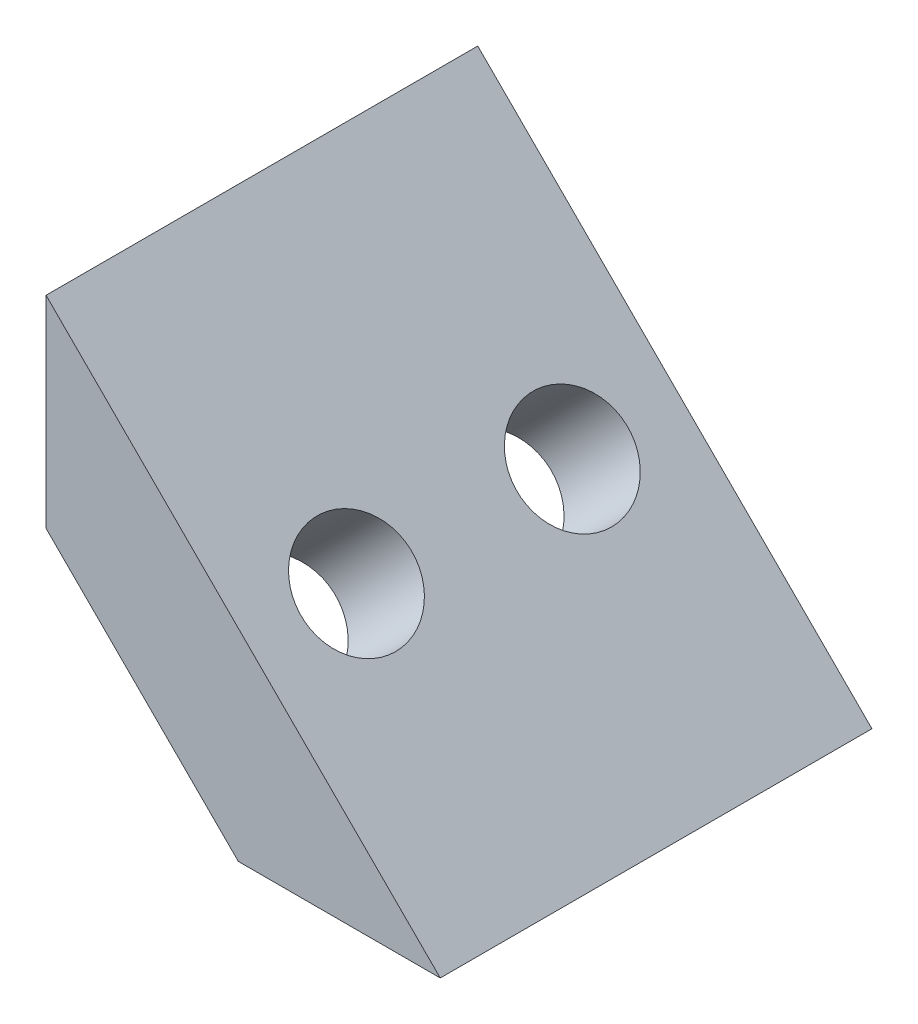
ISO-10303-21;
HEADER;
FILE_DESCRIPTION(('STEP AP214'),'2;1');
FILE_NAME('part.step','',(''),(''),'','','');
FILE_SCHEMA(('AUTOMOTIVE_DESIGN { 1 0 10303 214 1 1 1 1 }'));
ENDSEC;
DATA;
#1=APPLICATION_CONTEXT('core data for automotive mechanical design processes');
#2=APPLICATION_PROTOCOL_DEFINITION('international standard','automotive_design',2000,#1);
#3=PRODUCT_CONTEXT('',#1,'mechanical');
#4=PRODUCT('Part','Part','',(#3));
#5=PRODUCT_RELATED_PRODUCT_CATEGORY('part','',(#4));
#6=PRODUCT_DEFINITION_FORMATION('','',#4);
#7=PRODUCT_DEFINITION_CONTEXT('part definition',#1,'design');
#8=PRODUCT_DEFINITION('design','',#6,#7);
#9=PRODUCT_DEFINITION_SHAPE('','',#8);
#10=(LENGTH_UNIT() NAMED_UNIT(*) SI_UNIT(.MILLI.,.METRE.));
#11=(NAMED_UNIT(*) PLANE_ANGLE_UNIT() SI_UNIT($,.RADIAN.));
#12=(NAMED_UNIT(*) SI_UNIT($,.STERADIAN.) SOLID_ANGLE_UNIT());
#13=UNCERTAINTY_MEASURE_WITH_UNIT(LENGTH_MEASURE(1.E-05),#10,'distance_accuracy_value','');
#14=(GEOMETRIC_REPRESENTATION_CONTEXT(3) GLOBAL_UNCERTAINTY_ASSIGNED_CONTEXT((#13)) GLOBAL_UNIT_ASSIGNED_CONTEXT((#10,
#11,#12)) REPRESENTATION_CONTEXT('',''));
#15=CARTESIAN_POINT('',(0.,0.,0.));
#16=DIRECTION('',(0.,0.,1.));
#17=DIRECTION('',(1.,0.,0.));
#18=AXIS2_PLACEMENT_3D('',#15,#16,#17);
#19=CARTESIAN_POINT('',(0.,5.65685424949239,6.35));
#20=DIRECTION('',(1.,0.,0.));
#21=DIRECTION('',(0.,0.,-1.));
#22=AXIS2_PLACEMENT_3D('',#19,#20,#21);
#23=PLANE('',#22);
#24=DIRECTION('',(0.,-1.,0.));
#25=VECTOR('',#24,1.);
#26=CARTESIAN_POINT('',(0.,5.65685424949239,-6.35));
#27=LINE('',#26,#25);
#28=CARTESIAN_POINT('',(0.,11.5965512114594,-6.35));
#29=VERTEX_POINT('',#28);
#30=CARTESIAN_POINT('',(0.,5.65685424949239,-6.35));
#31=VERTEX_POINT('',#30);
#32=EDGE_CURVE('E98',#29,#31,#27,.T.);
#33=ORIENTED_EDGE('',*,*,#32,.T.);
#34=DIRECTION('',(0.,0.,-1.));
#35=VECTOR('',#34,1.);
#36=CARTESIAN_POINT('',(0.,5.65685424949239,6.35));
#37=LINE('',#36,#35);
#38=CARTESIAN_POINT('',(0.,5.65685424949239,6.35));
#39=VERTEX_POINT('',#38);
#40=EDGE_CURVE('E11',#39,#31,#37,.T.);
#41=ORIENTED_EDGE('',*,*,#40,.F.);
#42=DIRECTION('',(0.,-1.,0.));
#43=VECTOR('',#42,1.);
#44=CARTESIAN_POINT('',(0.,5.65685424949239,6.35));
#45=LINE('',#44,#43);
#46=CARTESIAN_POINT('',(0.,11.5965512114594,6.35));
#47=VERTEX_POINT('',#46);
#48=EDGE_CURVE('E85',#47,#39,#45,.T.);
#49=ORIENTED_EDGE('',*,*,#48,.F.);
#50=DIRECTION('',(0.,0.,-1.));
#51=VECTOR('',#50,1.);
#52=CARTESIAN_POINT('',(0.,11.5965512114594,6.35));
#53=LINE('',#52,#51);
#54=EDGE_CURVE('E94',#47,#29,#53,.T.);
#55=ORIENTED_EDGE('',*,*,#54,.T.);
#56=EDGE_LOOP('',(#33,#41,#49,#55));
#57=FACE_BOUND('',#56,.T.);
#58=ADVANCED_FACE('F32',(#57),#23,.F.);
#59=CARTESIAN_POINT('',(5.65685424949237,0.,6.35));
#60=DIRECTION('',(0.707106781186549,0.707106781186546,0.));
#61=DIRECTION('',(-0.707106781186546,0.707106781186549,0.));
#62=AXIS2_PLACEMENT_3D('',#59,#60,#61);
#63=PLANE('',#62);
#64=CARTESIAN_POINT('',(2.9873096858089,2.66954456368349,-3.17500000000001));
#65=DIRECTION('',(-0.707106781186548,-0.707106781186547,0.));
#66=DIRECTION('',(0.707106781186547,-0.707106781186548,0.));
#67=AXIS2_PLACEMENT_3D('',#64,#65,#66);
#68=CIRCLE('',#67,2.8575);
#69=CARTESIAN_POINT('',(5.00786731304945,0.648986936442925,-3.17500000000001));
#70=VERTEX_POINT('',#69);
#71=EDGE_CURVE('E121',#70,#70,#68,.T.);
#72=ORIENTED_EDGE('',*,*,#71,.F.);
#73=EDGE_LOOP('',(#72));
#74=FACE_BOUND('',#73,.T.);
#75=CARTESIAN_POINT('',(2.98730968580889,2.66954456368349,3.17500000000001));
#76=DIRECTION('',(-0.707106781186548,-0.707106781186547,0.));
#77=DIRECTION('',(0.707106781186547,-0.707106781186548,0.));
#78=AXIS2_PLACEMENT_3D('',#75,#76,#77);
#79=CIRCLE('',#78,2.8575);
#80=CARTESIAN_POINT('',(5.00786731304945,0.648986936442926,3.17500000000001));
#81=VERTEX_POINT('',#80);
#82=EDGE_CURVE('E111',#81,#81,#79,.T.);
#83=ORIENTED_EDGE('',*,*,#82,.F.);
#84=EDGE_LOOP('',(#83));
#85=FACE_BOUND('',#84,.T.);
#86=DIRECTION('',(0.707106781186546,-0.707106781186549,0.));
#87=VECTOR('',#86,1.);
#88=CARTESIAN_POINT('',(5.65685424949237,0.,-6.35));
#89=LINE('',#88,#87);
#90=CARTESIAN_POINT('',(5.65685424949237,0.,-6.35));
#91=VERTEX_POINT('',#90);
#92=EDGE_CURVE('E89',#31,#91,#89,.T.);
#93=ORIENTED_EDGE('',*,*,#92,.T.);
#94=DIRECTION('',(0.,0.,-1.));
#95=VECTOR('',#94,1.);
#96=CARTESIAN_POINT('',(5.65685424949237,0.,6.35));
#97=LINE('',#96,#95);
#98=CARTESIAN_POINT('',(5.65685424949237,0.,6.35));
#99=VERTEX_POINT('',#98);
#100=EDGE_CURVE('E41',#99,#91,#97,.T.);
#101=ORIENTED_EDGE('',*,*,#100,.F.);
#102=DIRECTION('',(0.707106781186546,-0.707106781186549,0.));
#103=VECTOR('',#102,1.);
#104=CARTESIAN_POINT('',(5.65685424949237,0.,6.35));
#105=LINE('',#104,#103);
#106=EDGE_CURVE('E80',#39,#99,#105,.T.);
#107=ORIENTED_EDGE('',*,*,#106,.F.);
#108=ORIENTED_EDGE('',*,*,#40,.T.);
#109=EDGE_LOOP('',(#93,#101,#107,#108));
#110=FACE_BOUND('',#109,.T.);
#111=ADVANCED_FACE('F88',(#74,#85,#110),#63,.F.);
#112=CARTESIAN_POINT('',(11.5965512114594,0.,6.35));
#113=DIRECTION('',(0.,1.,0.));
#114=DIRECTION('',(-1.,0.,0.));
#115=AXIS2_PLACEMENT_3D('',#112,#113,#114);
#116=PLANE('',#115);
#117=DIRECTION('',(1.,0.,0.));
#118=VECTOR('',#117,1.);
#119=CARTESIAN_POINT('',(11.5965512114594,0.,-6.35));
#120=LINE('',#119,#118);
#121=CARTESIAN_POINT('',(11.5965512114594,0.,-6.35));
#122=VERTEX_POINT('',#121);
#123=EDGE_CURVE('E67',#91,#122,#120,.T.);
#124=ORIENTED_EDGE('',*,*,#123,.T.);
#125=DIRECTION('',(0.,0.,-1.));
#126=VECTOR('',#125,1.);
#127=CARTESIAN_POINT('',(11.5965512114594,0.,6.35));
#128=LINE('',#127,#126);
#129=CARTESIAN_POINT('',(11.5965512114594,0.,6.35));
#130=VERTEX_POINT('',#129);
#131=EDGE_CURVE('E90',#130,#122,#128,.T.);
#132=ORIENTED_EDGE('',*,*,#131,.F.);
#133=DIRECTION('',(1.,0.,0.));
#134=VECTOR('',#133,1.);
#135=CARTESIAN_POINT('',(11.5965512114594,0.,6.35));
#136=LINE('',#135,#134);
#137=EDGE_CURVE('E83',#99,#130,#136,.T.);
#138=ORIENTED_EDGE('',*,*,#137,.F.);
#139=ORIENTED_EDGE('',*,*,#100,.T.);
#140=EDGE_LOOP('',(#124,#132,#138,#139));
#141=FACE_BOUND('',#140,.T.);
#142=ADVANCED_FACE('F92',(#141),#116,.F.);
#143=CARTESIAN_POINT('',(0.,11.5965512114594,6.35));
#144=DIRECTION('',(-0.707106781186549,-0.707106781186546,0.));
#145=DIRECTION('',(0.707106781186546,-0.707106781186549,0.));
#146=AXIS2_PLACEMENT_3D('',#143,#144,#145);
#147=PLANE('',#146);
#148=CARTESIAN_POINT('',(5.9571581667924,5.63939304466698,-3.17500000000001));
#149=DIRECTION('',(-0.707106781186549,-0.707106781186546,0.));
#150=DIRECTION('',(0.707106781186546,-0.707106781186549,0.));
#151=AXIS2_PLACEMENT_3D('',#148,#149,#150);
#152=CIRCLE('',#151,1.63195);
#153=CARTESIAN_POINT('',(7.11112107834978,4.48543013310959,-3.17500000000001));
#154=VERTEX_POINT('',#153);
#155=EDGE_CURVE('E35',#154,#154,#152,.T.);
#156=ORIENTED_EDGE('',*,*,#155,.T.);
#157=EDGE_LOOP('',(#156));
#158=FACE_BOUND('',#157,.T.);
#159=CARTESIAN_POINT('',(5.9571581667924,5.63939304466698,3.17500000000001));
#160=DIRECTION('',(-0.707106781186549,-0.707106781186546,0.));
#161=DIRECTION('',(0.707106781186546,-0.707106781186549,0.));
#162=AXIS2_PLACEMENT_3D('',#159,#160,#161);
#163=CIRCLE('',#162,1.63195);
#164=CARTESIAN_POINT('',(7.11112107834978,4.4854301331096,3.17500000000001));
#165=VERTEX_POINT('',#164);
#166=EDGE_CURVE('E101',#165,#165,#163,.T.);
#167=ORIENTED_EDGE('',*,*,#166,.T.);
#168=EDGE_LOOP('',(#167));
#169=FACE_BOUND('',#168,.T.);
#170=DIRECTION('',(-0.707106781186546,0.707106781186549,0.));
#171=VECTOR('',#170,1.);
#172=CARTESIAN_POINT('',(0.,11.5965512114594,-6.35));
#173=LINE('',#172,#171);
#174=EDGE_CURVE('E73',#122,#29,#173,.T.);
#175=ORIENTED_EDGE('',*,*,#174,.T.);
#176=ORIENTED_EDGE('',*,*,#54,.F.);
#177=DIRECTION('',(-0.707106781186546,0.707106781186549,0.));
#178=VECTOR('',#177,1.);
#179=CARTESIAN_POINT('',(0.,11.5965512114594,6.35));
#180=LINE('',#179,#178);
#181=EDGE_CURVE('E50',#130,#47,#180,.T.);
#182=ORIENTED_EDGE('',*,*,#181,.F.);
#183=ORIENTED_EDGE('',*,*,#131,.T.);
#184=EDGE_LOOP('',(#175,#176,#182,#183));
#185=FACE_BOUND('',#184,.T.);
#186=ADVANCED_FACE('F156',(#158,#169,#185),#147,.F.);
#187=CARTESIAN_POINT('',(0.,0.,6.35));
#188=DIRECTION('',(0.,0.,1.));
#189=DIRECTION('',(1.,0.,0.));
#190=AXIS2_PLACEMENT_3D('',#187,#188,#189);
#191=PLANE('',#190);
#192=ORIENTED_EDGE('',*,*,#48,.T.);
#193=ORIENTED_EDGE('',*,*,#106,.T.);
#194=ORIENTED_EDGE('',*,*,#137,.T.);
#195=ORIENTED_EDGE('',*,*,#181,.T.);
#196=EDGE_LOOP('',(#192,#193,#194,#195));
#197=FACE_BOUND('',#196,.T.);
#198=ADVANCED_FACE('F81',(#197),#191,.T.);
#199=CARTESIAN_POINT('',(0.,0.,-6.35));
#200=DIRECTION('',(0.,0.,1.));
#201=DIRECTION('',(1.,0.,0.));
#202=AXIS2_PLACEMENT_3D('',#199,#200,#201);
#203=PLANE('',#202);
#204=ORIENTED_EDGE('',*,*,#32,.F.);
#205=ORIENTED_EDGE('',*,*,#174,.F.);
#206=ORIENTED_EDGE('',*,*,#123,.F.);
#207=ORIENTED_EDGE('',*,*,#92,.F.);
#208=EDGE_LOOP('',(#204,#205,#206,#207));
#209=FACE_BOUND('',#208,.T.);
#210=ADVANCED_FACE('F143',(#209),#203,.F.);
#211=CARTESIAN_POINT('',(2.98730968580889,2.66954456368349,3.17500000000001));
#212=DIRECTION('',(-0.707106781186548,-0.707106781186547,0.));
#213=DIRECTION('',(0.707106781186547,-0.707106781186548,0.));
#214=AXIS2_PLACEMENT_3D('',#211,#212,#213);
#215=CYLINDRICAL_SURFACE('',#214,1.63195);
#216=CARTESIAN_POINT('',(3.71446899211882,3.39670386999342,3.17500000000001));
#217=DIRECTION('',(-0.707106781186548,-0.707106781186547,0.));
#218=DIRECTION('',(0.707106781186547,-0.707106781186548,0.));
#219=AXIS2_PLACEMENT_3D('',#216,#217,#218);
#220=CIRCLE('',#219,1.63195);
#221=CARTESIAN_POINT('',(4.86843190367621,2.24274095843603,3.17500000000001));
#222=VERTEX_POINT('',#221);
#223=EDGE_CURVE('E107',#222,#222,#220,.T.);
#224=ORIENTED_EDGE('',*,*,#223,.T.);
#225=EDGE_LOOP('',(#224));
#226=FACE_BOUND('',#225,.T.);
#227=ORIENTED_EDGE('',*,*,#166,.F.);
#228=EDGE_LOOP('',(#227));
#229=FACE_BOUND('',#228,.T.);
#230=ADVANCED_FACE('F134',(#226,#229),#215,.F.);
#231=CARTESIAN_POINT('',(2.98730968580889,2.66954456368349,3.17500000000001));
#232=DIRECTION('',(-0.707106781186548,-0.707106781186547,0.));
#233=DIRECTION('',(0.707106781186547,-0.707106781186548,0.));
#234=AXIS2_PLACEMENT_3D('',#231,#232,#233);
#235=CONICAL_SURFACE('',#234,2.8575,0.872664625997167);
#236=ORIENTED_EDGE('',*,*,#223,.F.);
#237=EDGE_LOOP('',(#236));
#238=FACE_BOUND('',#237,.T.);
#239=ORIENTED_EDGE('',*,*,#82,.T.);
#240=EDGE_LOOP('',(#239));
#241=FACE_BOUND('',#240,.T.);
#242=ADVANCED_FACE('F131',(#238,#241),#235,.F.);
#243=CARTESIAN_POINT('',(2.9873096858089,2.66954456368349,-3.17500000000001));
#244=DIRECTION('',(-0.707106781186548,-0.707106781186547,0.));
#245=DIRECTION('',(0.707106781186547,-0.707106781186548,0.));
#246=AXIS2_PLACEMENT_3D('',#243,#244,#245);
#247=CYLINDRICAL_SURFACE('',#246,1.63195);
#248=CARTESIAN_POINT('',(3.71446899211882,3.39670386999342,-3.17500000000001));
#249=DIRECTION('',(-0.707106781186548,-0.707106781186547,0.));
#250=DIRECTION('',(0.707106781186547,-0.707106781186548,0.));
#251=AXIS2_PLACEMENT_3D('',#248,#249,#250);
#252=CIRCLE('',#251,1.63195);
#253=CARTESIAN_POINT('',(4.86843190367621,2.24274095843603,-3.17500000000001));
#254=VERTEX_POINT('',#253);
#255=EDGE_CURVE('E118',#254,#254,#252,.T.);
#256=ORIENTED_EDGE('',*,*,#255,.T.);
#257=EDGE_LOOP('',(#256));
#258=FACE_BOUND('',#257,.T.);
#259=ORIENTED_EDGE('',*,*,#155,.F.);
#260=EDGE_LOOP('',(#259));
#261=FACE_BOUND('',#260,.T.);
#262=ADVANCED_FACE('F133',(#258,#261),#247,.F.);
#263=CARTESIAN_POINT('',(2.9873096858089,2.66954456368349,-3.17500000000001));
#264=DIRECTION('',(-0.707106781186548,-0.707106781186547,0.));
#265=DIRECTION('',(0.707106781186547,-0.707106781186548,0.));
#266=AXIS2_PLACEMENT_3D('',#263,#264,#265);
#267=CONICAL_SURFACE('',#266,2.8575,0.872664625997167);
#268=ORIENTED_EDGE('',*,*,#255,.F.);
#269=EDGE_LOOP('',(#268));
#270=FACE_BOUND('',#269,.T.);
#271=ORIENTED_EDGE('',*,*,#71,.T.);
#272=EDGE_LOOP('',(#271));
#273=FACE_BOUND('',#272,.T.);
#274=ADVANCED_FACE('F125',(#270,#273),#267,.F.);
#275=CLOSED_SHELL('',(#58,#111,#142,#186,#198,#210,#230,#242,#262,#274));
#276=MANIFOLD_SOLID_BREP('B2',#275);
#277=ADVANCED_BREP_SHAPE_REPRESENTATION('',(#18,#276),#14);
#278=SHAPE_DEFINITION_REPRESENTATION(#9,#277);
ENDSEC;
END-ISO-10303-21;
